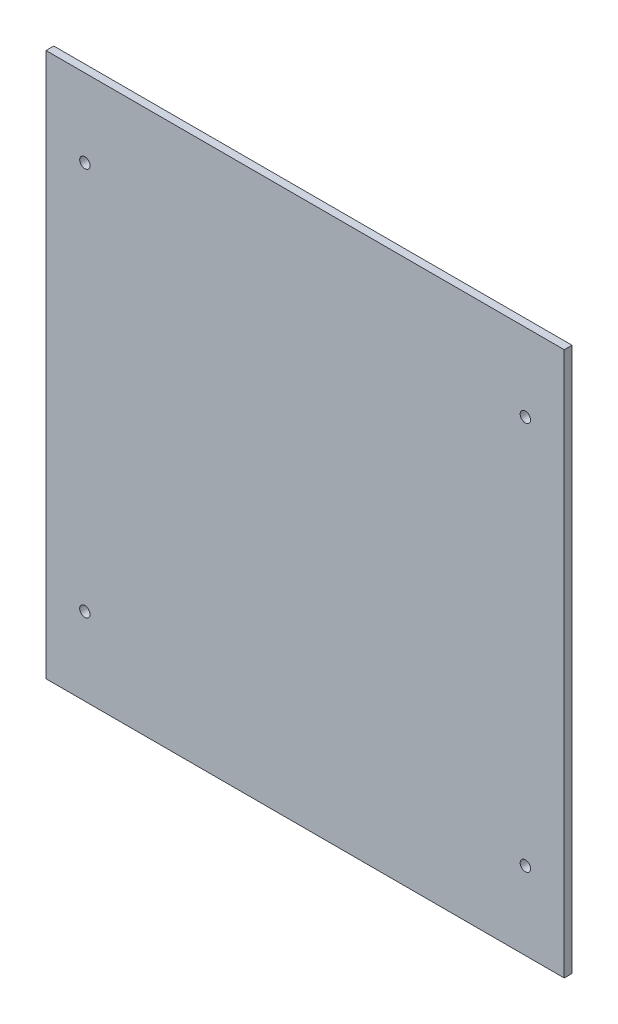
ISO-10303-21;
HEADER;
FILE_DESCRIPTION(('STEP AP214'),'2;1');
FILE_NAME('part.step','',(''),(''),'','','');
FILE_SCHEMA(('AUTOMOTIVE_DESIGN { 1 0 10303 214 1 1 1 1 }'));
ENDSEC;
DATA;
#1=APPLICATION_CONTEXT('core data for automotive mechanical design processes');
#2=APPLICATION_PROTOCOL_DEFINITION('international standard','automotive_design',2000,#1);
#3=PRODUCT_CONTEXT('',#1,'mechanical');
#4=PRODUCT('Part','Part','',(#3));
#5=PRODUCT_RELATED_PRODUCT_CATEGORY('part','',(#4));
#6=PRODUCT_DEFINITION_FORMATION('','',#4);
#7=PRODUCT_DEFINITION_CONTEXT('part definition',#1,'design');
#8=PRODUCT_DEFINITION('design','',#6,#7);
#9=PRODUCT_DEFINITION_SHAPE('','',#8);
#10=(LENGTH_UNIT() NAMED_UNIT(*) SI_UNIT(.MILLI.,.METRE.));
#11=(NAMED_UNIT(*) PLANE_ANGLE_UNIT() SI_UNIT($,.RADIAN.));
#12=(NAMED_UNIT(*) SI_UNIT($,.STERADIAN.) SOLID_ANGLE_UNIT());
#13=UNCERTAINTY_MEASURE_WITH_UNIT(LENGTH_MEASURE(1.E-05),#10,'distance_accuracy_value','');
#14=(GEOMETRIC_REPRESENTATION_CONTEXT(3) GLOBAL_UNCERTAINTY_ASSIGNED_CONTEXT((#13)) GLOBAL_UNIT_ASSIGNED_CONTEXT((#10,
#11,#12)) REPRESENTATION_CONTEXT('',''));
#15=CARTESIAN_POINT('',(0.,0.,0.));
#16=DIRECTION('',(0.,0.,1.));
#17=DIRECTION('',(1.,0.,0.));
#18=AXIS2_PLACEMENT_3D('',#15,#16,#17);
#19=CARTESIAN_POINT('',(0.,0.,3.));
#20=DIRECTION('',(1.,0.,0.));
#21=DIRECTION('',(0.,1.,0.));
#22=AXIS2_PLACEMENT_3D('',#19,#20,#21);
#23=PLANE('',#22);
#24=DIRECTION('',(0.,-1.,0.));
#25=VECTOR('',#24,1.);
#26=CARTESIAN_POINT('',(0.,0.,0.));
#27=LINE('',#26,#25);
#28=CARTESIAN_POINT('',(0.,210.,0.));
#29=VERTEX_POINT('',#28);
#30=CARTESIAN_POINT('',(0.,0.,0.));
#31=VERTEX_POINT('',#30);
#32=EDGE_CURVE('E107',#29,#31,#27,.T.);
#33=ORIENTED_EDGE('',*,*,#32,.T.);
#34=DIRECTION('',(0.,0.,-1.));
#35=VECTOR('',#34,1.);
#36=CARTESIAN_POINT('',(0.,0.,3.));
#37=LINE('',#36,#35);
#38=CARTESIAN_POINT('',(0.,0.,3.));
#39=VERTEX_POINT('',#38);
#40=EDGE_CURVE('E11',#39,#31,#37,.T.);
#41=ORIENTED_EDGE('',*,*,#40,.F.);
#42=DIRECTION('',(0.,-1.,0.));
#43=VECTOR('',#42,1.);
#44=CARTESIAN_POINT('',(0.,0.,3.));
#45=LINE('',#44,#43);
#46=CARTESIAN_POINT('',(0.,210.,3.));
#47=VERTEX_POINT('',#46);
#48=EDGE_CURVE('E91',#47,#39,#45,.T.);
#49=ORIENTED_EDGE('',*,*,#48,.F.);
#50=DIRECTION('',(0.,0.,-1.));
#51=VECTOR('',#50,1.);
#52=CARTESIAN_POINT('',(0.,210.,3.));
#53=LINE('',#52,#51);
#54=EDGE_CURVE('E103',#47,#29,#53,.T.);
#55=ORIENTED_EDGE('',*,*,#54,.T.);
#56=EDGE_LOOP('',(#33,#41,#49,#55));
#57=FACE_BOUND('',#56,.T.);
#58=ADVANCED_FACE('F39',(#57),#23,.F.);
#59=CARTESIAN_POINT('',(0.,0.,3.));
#60=DIRECTION('',(0.,1.,0.));
#61=DIRECTION('',(0.,0.,1.));
#62=AXIS2_PLACEMENT_3D('',#59,#60,#61);
#63=PLANE('',#62);
#64=DIRECTION('',(1.,0.,0.));
#65=VECTOR('',#64,1.);
#66=CARTESIAN_POINT('',(0.,0.,0.));
#67=LINE('',#66,#65);
#68=CARTESIAN_POINT('',(200.,0.,0.));
#69=VERTEX_POINT('',#68);
#70=EDGE_CURVE('E96',#31,#69,#67,.T.);
#71=ORIENTED_EDGE('',*,*,#70,.T.);
#72=DIRECTION('',(0.,0.,-1.));
#73=VECTOR('',#72,1.);
#74=CARTESIAN_POINT('',(200.,0.,3.));
#75=LINE('',#74,#73);
#76=CARTESIAN_POINT('',(200.,0.,3.));
#77=VERTEX_POINT('',#76);
#78=EDGE_CURVE('E48',#77,#69,#75,.T.);
#79=ORIENTED_EDGE('',*,*,#78,.F.);
#80=DIRECTION('',(1.,0.,0.));
#81=VECTOR('',#80,1.);
#82=CARTESIAN_POINT('',(0.,0.,3.));
#83=LINE('',#82,#81);
#84=EDGE_CURVE('E86',#39,#77,#83,.T.);
#85=ORIENTED_EDGE('',*,*,#84,.F.);
#86=ORIENTED_EDGE('',*,*,#40,.T.);
#87=EDGE_LOOP('',(#71,#79,#85,#86));
#88=FACE_BOUND('',#87,.T.);
#89=ADVANCED_FACE('F95',(#88),#63,.F.);
#90=CARTESIAN_POINT('',(200.,0.,3.));
#91=DIRECTION('',(-1.,0.,0.));
#92=DIRECTION('',(0.,-1.,0.));
#93=AXIS2_PLACEMENT_3D('',#90,#91,#92);
#94=PLANE('',#93);
#95=DIRECTION('',(0.,1.,0.));
#96=VECTOR('',#95,1.);
#97=CARTESIAN_POINT('',(200.,0.,0.));
#98=LINE('',#97,#96);
#99=CARTESIAN_POINT('',(200.,210.,0.));
#100=VERTEX_POINT('',#99);
#101=EDGE_CURVE('E73',#69,#100,#98,.T.);
#102=ORIENTED_EDGE('',*,*,#101,.T.);
#103=DIRECTION('',(0.,0.,-1.));
#104=VECTOR('',#103,1.);
#105=CARTESIAN_POINT('',(200.,210.,3.));
#106=LINE('',#105,#104);
#107=CARTESIAN_POINT('',(200.,210.,3.));
#108=VERTEX_POINT('',#107);
#109=EDGE_CURVE('E98',#108,#100,#106,.T.);
#110=ORIENTED_EDGE('',*,*,#109,.F.);
#111=DIRECTION('',(0.,1.,0.));
#112=VECTOR('',#111,1.);
#113=CARTESIAN_POINT('',(200.,0.,3.));
#114=LINE('',#113,#112);
#115=EDGE_CURVE('E89',#77,#108,#114,.T.);
#116=ORIENTED_EDGE('',*,*,#115,.F.);
#117=ORIENTED_EDGE('',*,*,#78,.T.);
#118=EDGE_LOOP('',(#102,#110,#116,#117));
#119=FACE_BOUND('',#118,.T.);
#120=ADVANCED_FACE('F99',(#119),#94,.F.);
#121=CARTESIAN_POINT('',(0.,210.,3.));
#122=DIRECTION('',(0.,-1.,0.));
#123=DIRECTION('',(0.,0.,-1.));
#124=AXIS2_PLACEMENT_3D('',#121,#122,#123);
#125=PLANE('',#124);
#126=DIRECTION('',(-1.,0.,0.));
#127=VECTOR('',#126,1.);
#128=CARTESIAN_POINT('',(0.,210.,0.));
#129=LINE('',#128,#127);
#130=EDGE_CURVE('E79',#100,#29,#129,.T.);
#131=ORIENTED_EDGE('',*,*,#130,.T.);
#132=ORIENTED_EDGE('',*,*,#54,.F.);
#133=DIRECTION('',(-1.,0.,0.));
#134=VECTOR('',#133,1.);
#135=CARTESIAN_POINT('',(0.,210.,3.));
#136=LINE('',#135,#134);
#137=EDGE_CURVE('E56',#108,#47,#136,.T.);
#138=ORIENTED_EDGE('',*,*,#137,.F.);
#139=ORIENTED_EDGE('',*,*,#109,.T.);
#140=EDGE_LOOP('',(#131,#132,#138,#139));
#141=FACE_BOUND('',#140,.T.);
#142=ADVANCED_FACE('F121',(#141),#125,.F.);
#143=CARTESIAN_POINT('',(0.,0.,3.));
#144=DIRECTION('',(0.,0.,-1.));
#145=DIRECTION('',(-1.,0.,0.));
#146=AXIS2_PLACEMENT_3D('',#143,#144,#145);
#147=PLANE('',#146);
#148=CARTESIAN_POINT('',(14.9999999999999,180.,3.));
#149=DIRECTION('',(0.,0.,-1.));
#150=DIRECTION('',(-1.,0.,0.));
#151=AXIS2_PLACEMENT_3D('',#148,#149,#150);
#152=CIRCLE('',#151,2.);
#153=CARTESIAN_POINT('',(12.9999999999999,180.,3.));
#154=VERTEX_POINT('',#153);
#155=EDGE_CURVE('E111',#154,#154,#152,.T.);
#156=ORIENTED_EDGE('',*,*,#155,.T.);
#157=EDGE_LOOP('',(#156));
#158=FACE_BOUND('',#157,.T.);
#159=CARTESIAN_POINT('',(14.9999999999999,30.,3.));
#160=DIRECTION('',(0.,0.,-1.));
#161=DIRECTION('',(-1.,0.,0.));
#162=AXIS2_PLACEMENT_3D('',#159,#160,#161);
#163=CIRCLE('',#162,2.);
#164=CARTESIAN_POINT('',(12.9999999999999,30.,3.));
#165=VERTEX_POINT('',#164);
#166=EDGE_CURVE('E131',#165,#165,#163,.T.);
#167=ORIENTED_EDGE('',*,*,#166,.T.);
#168=EDGE_LOOP('',(#167));
#169=FACE_BOUND('',#168,.T.);
#170=CARTESIAN_POINT('',(185.,30.,3.));
#171=DIRECTION('',(0.,0.,-1.));
#172=DIRECTION('',(-1.,0.,0.));
#173=AXIS2_PLACEMENT_3D('',#170,#171,#172);
#174=CIRCLE('',#173,2.);
#175=CARTESIAN_POINT('',(183.,30.,3.));
#176=VERTEX_POINT('',#175);
#177=EDGE_CURVE('E135',#176,#176,#174,.T.);
#178=ORIENTED_EDGE('',*,*,#177,.T.);
#179=EDGE_LOOP('',(#178));
#180=FACE_BOUND('',#179,.T.);
#181=CARTESIAN_POINT('',(185.,180.,3.));
#182=DIRECTION('',(0.,0.,-1.));
#183=DIRECTION('',(-1.,0.,0.));
#184=AXIS2_PLACEMENT_3D('',#181,#182,#183);
#185=CIRCLE('',#184,2.);
#186=CARTESIAN_POINT('',(183.,180.,3.));
#187=VERTEX_POINT('',#186);
#188=EDGE_CURVE('E139',#187,#187,#185,.T.);
#189=ORIENTED_EDGE('',*,*,#188,.T.);
#190=EDGE_LOOP('',(#189));
#191=FACE_BOUND('',#190,.T.);
#192=ORIENTED_EDGE('',*,*,#48,.T.);
#193=ORIENTED_EDGE('',*,*,#84,.T.);
#194=ORIENTED_EDGE('',*,*,#115,.T.);
#195=ORIENTED_EDGE('',*,*,#137,.T.);
#196=EDGE_LOOP('',(#192,#193,#194,#195));
#197=FACE_BOUND('',#196,.T.);
#198=ADVANCED_FACE('F87',(#158,#169,#180,#191,#197),#147,.F.);
#199=CARTESIAN_POINT('',(0.,0.,0.));
#200=DIRECTION('',(0.,0.,-1.));
#201=DIRECTION('',(-1.,0.,0.));
#202=AXIS2_PLACEMENT_3D('',#199,#200,#201);
#203=PLANE('',#202);
#204=CARTESIAN_POINT('',(14.9999999999999,180.,0.));
#205=DIRECTION('',(0.,0.,-1.));
#206=DIRECTION('',(-1.,0.,0.));
#207=AXIS2_PLACEMENT_3D('',#204,#205,#206);
#208=CIRCLE('',#207,2.);
#209=CARTESIAN_POINT('',(12.9999999999999,180.,0.));
#210=VERTEX_POINT('',#209);
#211=EDGE_CURVE('E148',#210,#210,#208,.T.);
#212=ORIENTED_EDGE('',*,*,#211,.F.);
#213=EDGE_LOOP('',(#212));
#214=FACE_BOUND('',#213,.T.);
#215=CARTESIAN_POINT('',(14.9999999999999,30.,0.));
#216=DIRECTION('',(0.,0.,-1.));
#217=DIRECTION('',(-1.,0.,0.));
#218=AXIS2_PLACEMENT_3D('',#215,#216,#217);
#219=CIRCLE('',#218,2.);
#220=CARTESIAN_POINT('',(12.9999999999999,30.,0.));
#221=VERTEX_POINT('',#220);
#222=EDGE_CURVE('E152',#221,#221,#219,.T.);
#223=ORIENTED_EDGE('',*,*,#222,.F.);
#224=EDGE_LOOP('',(#223));
#225=FACE_BOUND('',#224,.T.);
#226=CARTESIAN_POINT('',(185.,30.,0.));
#227=DIRECTION('',(0.,0.,-1.));
#228=DIRECTION('',(-1.,0.,0.));
#229=AXIS2_PLACEMENT_3D('',#226,#227,#228);
#230=CIRCLE('',#229,2.);
#231=CARTESIAN_POINT('',(183.,30.,0.));
#232=VERTEX_POINT('',#231);
#233=EDGE_CURVE('E147',#232,#232,#230,.T.);
#234=ORIENTED_EDGE('',*,*,#233,.F.);
#235=EDGE_LOOP('',(#234));
#236=FACE_BOUND('',#235,.T.);
#237=CARTESIAN_POINT('',(185.,180.,0.));
#238=DIRECTION('',(0.,0.,-1.));
#239=DIRECTION('',(-1.,0.,0.));
#240=AXIS2_PLACEMENT_3D('',#237,#238,#239);
#241=CIRCLE('',#240,2.);
#242=CARTESIAN_POINT('',(183.,180.,0.));
#243=VERTEX_POINT('',#242);
#244=EDGE_CURVE('E143',#243,#243,#241,.T.);
#245=ORIENTED_EDGE('',*,*,#244,.F.);
#246=EDGE_LOOP('',(#245));
#247=FACE_BOUND('',#246,.T.);
#248=ORIENTED_EDGE('',*,*,#32,.F.);
#249=ORIENTED_EDGE('',*,*,#130,.F.);
#250=ORIENTED_EDGE('',*,*,#101,.F.);
#251=ORIENTED_EDGE('',*,*,#70,.F.);
#252=EDGE_LOOP('',(#248,#249,#250,#251));
#253=FACE_BOUND('',#252,.T.);
#254=ADVANCED_FACE('F124',(#214,#225,#236,#247,#253),#203,.T.);
#255=CARTESIAN_POINT('',(185.,180.,100.));
#256=DIRECTION('',(0.,0.,-1.));
#257=DIRECTION('',(-1.,0.,0.));
#258=AXIS2_PLACEMENT_3D('',#255,#256,#257);
#259=CYLINDRICAL_SURFACE('',#258,2.);
#260=ORIENTED_EDGE('',*,*,#244,.T.);
#261=EDGE_LOOP('',(#260));
#262=FACE_BOUND('',#261,.T.);
#263=ORIENTED_EDGE('',*,*,#188,.F.);
#264=EDGE_LOOP('',(#263));
#265=FACE_BOUND('',#264,.T.);
#266=ADVANCED_FACE('F165',(#262,#265),#259,.F.);
#267=CARTESIAN_POINT('',(185.,30.,100.));
#268=DIRECTION('',(0.,0.,-1.));
#269=DIRECTION('',(-1.,0.,0.));
#270=AXIS2_PLACEMENT_3D('',#267,#268,#269);
#271=CYLINDRICAL_SURFACE('',#270,2.);
#272=ORIENTED_EDGE('',*,*,#233,.T.);
#273=EDGE_LOOP('',(#272));
#274=FACE_BOUND('',#273,.T.);
#275=ORIENTED_EDGE('',*,*,#177,.F.);
#276=EDGE_LOOP('',(#275));
#277=FACE_BOUND('',#276,.T.);
#278=ADVANCED_FACE('F160',(#274,#277),#271,.F.);
#279=CARTESIAN_POINT('',(14.9999999999999,30.,100.));
#280=DIRECTION('',(0.,0.,-1.));
#281=DIRECTION('',(-1.,0.,0.));
#282=AXIS2_PLACEMENT_3D('',#279,#280,#281);
#283=CYLINDRICAL_SURFACE('',#282,2.);
#284=ORIENTED_EDGE('',*,*,#222,.T.);
#285=EDGE_LOOP('',(#284));
#286=FACE_BOUND('',#285,.T.);
#287=ORIENTED_EDGE('',*,*,#166,.F.);
#288=EDGE_LOOP('',(#287));
#289=FACE_BOUND('',#288,.T.);
#290=ADVANCED_FACE('F222',(#286,#289),#283,.F.);
#291=CARTESIAN_POINT('',(14.9999999999999,180.,100.));
#292=DIRECTION('',(0.,0.,-1.));
#293=DIRECTION('',(-1.,0.,0.));
#294=AXIS2_PLACEMENT_3D('',#291,#292,#293);
#295=CYLINDRICAL_SURFACE('',#294,2.);
#296=ORIENTED_EDGE('',*,*,#211,.T.);
#297=EDGE_LOOP('',(#296));
#298=FACE_BOUND('',#297,.T.);
#299=ORIENTED_EDGE('',*,*,#155,.F.);
#300=EDGE_LOOP('',(#299));
#301=FACE_BOUND('',#300,.T.);
#302=ADVANCED_FACE('F231',(#298,#301),#295,.F.);
#303=CLOSED_SHELL('',(#58,#89,#120,#142,#198,#254,#266,#278,#290,#302));
#304=MANIFOLD_SOLID_BREP('B2',#303);
#305=ADVANCED_BREP_SHAPE_REPRESENTATION('',(#18,#304),#14);
#306=SHAPE_DEFINITION_REPRESENTATION(#9,#305);
ENDSEC;
END-ISO-10303-21;
